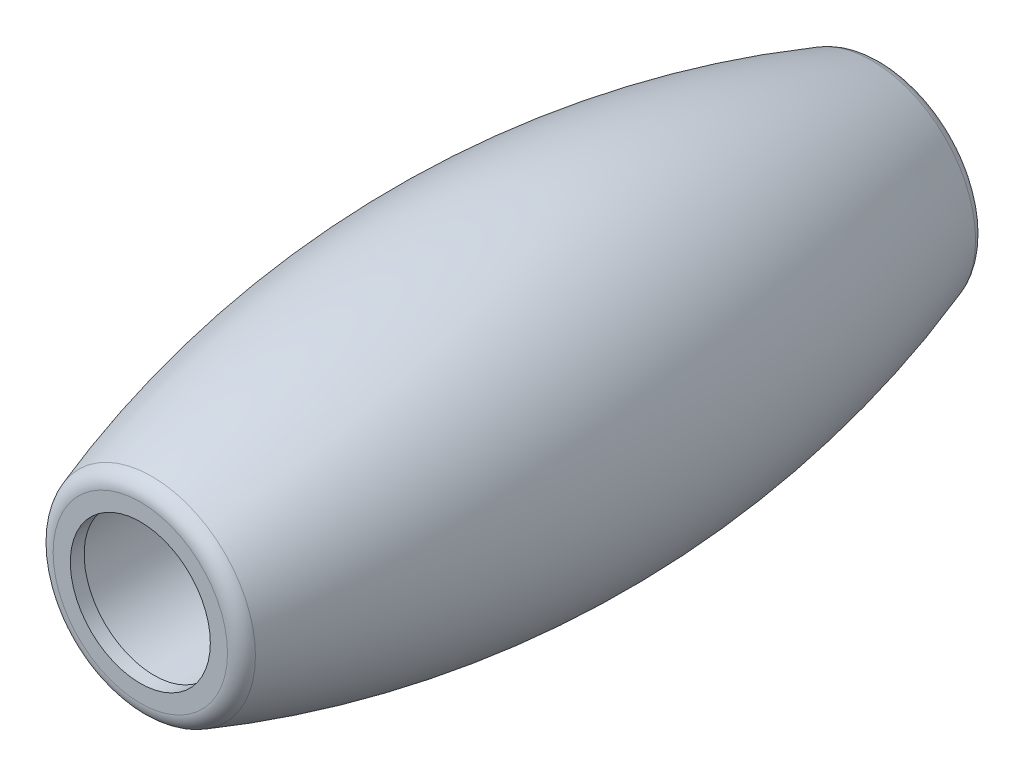
ISO-10303-21;
HEADER;
FILE_DESCRIPTION(('STEP AP214'),'2;1');
FILE_NAME('part.step','',(''),(''),'','','');
FILE_SCHEMA(('AUTOMOTIVE_DESIGN { 1 0 10303 214 1 1 1 1 }'));
ENDSEC;
DATA;
#1=APPLICATION_CONTEXT('core data for automotive mechanical design processes');
#2=APPLICATION_PROTOCOL_DEFINITION('international standard','automotive_design',2000,#1);
#3=PRODUCT_CONTEXT('',#1,'mechanical');
#4=PRODUCT('Part','Part','',(#3));
#5=PRODUCT_RELATED_PRODUCT_CATEGORY('part','',(#4));
#6=PRODUCT_DEFINITION_FORMATION('','',#4);
#7=PRODUCT_DEFINITION_CONTEXT('part definition',#1,'design');
#8=PRODUCT_DEFINITION('design','',#6,#7);
#9=PRODUCT_DEFINITION_SHAPE('','',#8);
#10=(LENGTH_UNIT() NAMED_UNIT(*) SI_UNIT(.MILLI.,.METRE.));
#11=(NAMED_UNIT(*) PLANE_ANGLE_UNIT() SI_UNIT($,.RADIAN.));
#12=(NAMED_UNIT(*) SI_UNIT($,.STERADIAN.) SOLID_ANGLE_UNIT());
#13=UNCERTAINTY_MEASURE_WITH_UNIT(LENGTH_MEASURE(1.E-05),#10,'distance_accuracy_value','');
#14=(GEOMETRIC_REPRESENTATION_CONTEXT(3) GLOBAL_UNCERTAINTY_ASSIGNED_CONTEXT((#13)) GLOBAL_UNIT_ASSIGNED_CONTEXT((#10,
#11,#12)) REPRESENTATION_CONTEXT('',''));
#15=CARTESIAN_POINT('',(0.,0.,0.));
#16=DIRECTION('',(0.,0.,1.));
#17=DIRECTION('',(1.,0.,0.));
#18=AXIS2_PLACEMENT_3D('',#15,#16,#17);
#19=CARTESIAN_POINT('',(0.,0.,0.));
#20=DIRECTION('',(0.,0.,1.));
#21=DIRECTION('',(1.,0.,0.));
#22=AXIS2_PLACEMENT_3D('',#19,#20,#21);
#23=DEGENERATE_TOROIDAL_SURFACE('',#22,32.405,38.105,.F.);
#24=CARTESIAN_POINT('',(0.,0.,-12.4967737634982));
#25=DIRECTION('',(0.,0.,1.));
#26=DIRECTION('',(1.,0.,0.));
#27=AXIS2_PLACEMENT_3D('',#24,#25,#26);
#28=CIRCLE('',#27,3.59252311623597);
#29=CARTESIAN_POINT('',(3.59252311623597,0.,-12.4967737634982));
#30=VERTEX_POINT('',#29);
#31=EDGE_CURVE('E43',#30,#30,#28,.T.);
#32=ORIENTED_EDGE('',*,*,#31,.T.);
#33=EDGE_LOOP('',(#32));
#34=FACE_BOUND('',#33,.T.);
#35=CARTESIAN_POINT('',(0.,0.,12.4967737634982));
#36=DIRECTION('',(0.,0.,-1.));
#37=DIRECTION('',(-1.,0.,0.));
#38=AXIS2_PLACEMENT_3D('',#35,#36,#37);
#39=CIRCLE('',#38,3.59252311623597);
#40=CARTESIAN_POINT('',(-3.59252311623597,0.,12.4967737634982));
#41=VERTEX_POINT('',#40);
#42=EDGE_CURVE('E47',#41,#41,#39,.T.);
#43=ORIENTED_EDGE('',*,*,#42,.T.);
#44=EDGE_LOOP('',(#43));
#45=FACE_BOUND('',#44,.T.);
#46=ADVANCED_FACE('F32',(#34,#45),#23,.F.);
#47=CARTESIAN_POINT('',(0.,2.43,12.9));
#48=DIRECTION('',(0.,0.,-1.));
#49=DIRECTION('',(-1.,0.,0.));
#50=AXIS2_PLACEMENT_3D('',#47,#48,#49);
#51=PLANE('',#50);
#52=CARTESIAN_POINT('',(0.,0.,12.9));
#53=DIRECTION('',(0.,0.,-1.));
#54=DIRECTION('',(-1.,0.,0.));
#55=AXIS2_PLACEMENT_3D('',#52,#53,#54);
#56=CIRCLE('',#55,3.02570737368928);
#57=CARTESIAN_POINT('',(-3.02570737368928,0.,12.9));
#58=VERTEX_POINT('',#57);
#59=EDGE_CURVE('E10',#58,#58,#56,.F.);
#60=ORIENTED_EDGE('',*,*,#59,.T.);
#61=EDGE_LOOP('',(#60));
#62=FACE_BOUND('',#61,.T.);
#63=CARTESIAN_POINT('',(0.,0.,12.9));
#64=DIRECTION('',(0.,0.,1.));
#65=DIRECTION('',(1.,0.,0.));
#66=AXIS2_PLACEMENT_3D('',#63,#64,#65);
#67=CIRCLE('',#66,2.43);
#68=CARTESIAN_POINT('',(2.43,0.,12.9));
#69=VERTEX_POINT('',#68);
#70=EDGE_CURVE('E52',#69,#69,#67,.T.);
#71=ORIENTED_EDGE('',*,*,#70,.F.);
#72=EDGE_LOOP('',(#71));
#73=FACE_BOUND('',#72,.T.);
#74=ADVANCED_FACE('F100',(#62,#73),#51,.F.);
#75=CARTESIAN_POINT('',(0.,0.,12.9));
#76=DIRECTION('',(0.,0.,1.));
#77=DIRECTION('',(1.,0.,0.));
#78=AXIS2_PLACEMENT_3D('',#75,#76,#77);
#79=CYLINDRICAL_SURFACE('',#78,2.43);
#80=CARTESIAN_POINT('',(0.,0.,12.42));
#81=DIRECTION('',(0.,0.,1.));
#82=DIRECTION('',(1.,0.,0.));
#83=AXIS2_PLACEMENT_3D('',#80,#81,#82);
#84=CIRCLE('',#83,2.43);
#85=CARTESIAN_POINT('',(2.43,0.,12.42));
#86=VERTEX_POINT('',#85);
#87=EDGE_CURVE('E55',#86,#86,#84,.T.);
#88=ORIENTED_EDGE('',*,*,#87,.F.);
#89=EDGE_LOOP('',(#88));
#90=FACE_BOUND('',#89,.T.);
#91=ORIENTED_EDGE('',*,*,#70,.T.);
#92=EDGE_LOOP('',(#91));
#93=FACE_BOUND('',#92,.T.);
#94=ADVANCED_FACE('F94',(#90,#93),#79,.F.);
#95=CARTESIAN_POINT('',(0.,2.7,12.42));
#96=DIRECTION('',(0.,0.,1.));
#97=DIRECTION('',(1.,0.,0.));
#98=AXIS2_PLACEMENT_3D('',#95,#96,#97);
#99=PLANE('',#98);
#100=CARTESIAN_POINT('',(0.,0.,12.42));
#101=DIRECTION('',(0.,0.,1.));
#102=DIRECTION('',(1.,0.,0.));
#103=AXIS2_PLACEMENT_3D('',#100,#101,#102);
#104=CIRCLE('',#103,2.7);
#105=CARTESIAN_POINT('',(2.7,0.,12.42));
#106=VERTEX_POINT('',#105);
#107=EDGE_CURVE('E58',#106,#106,#104,.T.);
#108=ORIENTED_EDGE('',*,*,#107,.F.);
#109=EDGE_LOOP('',(#108));
#110=FACE_BOUND('',#109,.T.);
#111=ORIENTED_EDGE('',*,*,#87,.T.);
#112=EDGE_LOOP('',(#111));
#113=FACE_BOUND('',#112,.T.);
#114=ADVANCED_FACE('F88',(#110,#113),#99,.F.);
#115=CARTESIAN_POINT('',(0.,0.,12.9));
#116=DIRECTION('',(0.,0.,1.));
#117=DIRECTION('',(1.,0.,0.));
#118=AXIS2_PLACEMENT_3D('',#115,#116,#117);
#119=CYLINDRICAL_SURFACE('',#118,2.7);
#120=CARTESIAN_POINT('',(0.,0.,-12.42));
#121=DIRECTION('',(0.,0.,1.));
#122=DIRECTION('',(1.,0.,0.));
#123=AXIS2_PLACEMENT_3D('',#120,#121,#122);
#124=CIRCLE('',#123,2.7);
#125=CARTESIAN_POINT('',(2.7,0.,-12.42));
#126=VERTEX_POINT('',#125);
#127=EDGE_CURVE('E61',#126,#126,#124,.T.);
#128=ORIENTED_EDGE('',*,*,#127,.F.);
#129=EDGE_LOOP('',(#128));
#130=FACE_BOUND('',#129,.T.);
#131=ORIENTED_EDGE('',*,*,#107,.T.);
#132=EDGE_LOOP('',(#131));
#133=FACE_BOUND('',#132,.T.);
#134=ADVANCED_FACE('F82',(#130,#133),#119,.F.);
#135=CARTESIAN_POINT('',(0.,2.7,-12.42));
#136=DIRECTION('',(0.,0.,-1.));
#137=DIRECTION('',(-1.,0.,0.));
#138=AXIS2_PLACEMENT_3D('',#135,#136,#137);
#139=PLANE('',#138);
#140=CARTESIAN_POINT('',(0.,0.,-12.42));
#141=DIRECTION('',(0.,0.,1.));
#142=DIRECTION('',(1.,0.,0.));
#143=AXIS2_PLACEMENT_3D('',#140,#141,#142);
#144=CIRCLE('',#143,2.43);
#145=CARTESIAN_POINT('',(2.43,0.,-12.42));
#146=VERTEX_POINT('',#145);
#147=EDGE_CURVE('E64',#146,#146,#144,.T.);
#148=ORIENTED_EDGE('',*,*,#147,.F.);
#149=EDGE_LOOP('',(#148));
#150=FACE_BOUND('',#149,.T.);
#151=ORIENTED_EDGE('',*,*,#127,.T.);
#152=EDGE_LOOP('',(#151));
#153=FACE_BOUND('',#152,.T.);
#154=ADVANCED_FACE('F76',(#150,#153),#139,.F.);
#155=CARTESIAN_POINT('',(0.,0.,12.9));
#156=DIRECTION('',(0.,0.,1.));
#157=DIRECTION('',(1.,0.,0.));
#158=AXIS2_PLACEMENT_3D('',#155,#156,#157);
#159=CYLINDRICAL_SURFACE('',#158,2.43);
#160=CARTESIAN_POINT('',(0.,0.,-12.9));
#161=DIRECTION('',(0.,0.,1.));
#162=DIRECTION('',(1.,0.,0.));
#163=AXIS2_PLACEMENT_3D('',#160,#161,#162);
#164=CIRCLE('',#163,2.43);
#165=CARTESIAN_POINT('',(2.43,0.,-12.9));
#166=VERTEX_POINT('',#165);
#167=EDGE_CURVE('E67',#166,#166,#164,.T.);
#168=ORIENTED_EDGE('',*,*,#167,.F.);
#169=EDGE_LOOP('',(#168));
#170=FACE_BOUND('',#169,.T.);
#171=ORIENTED_EDGE('',*,*,#147,.T.);
#172=EDGE_LOOP('',(#171));
#173=FACE_BOUND('',#172,.T.);
#174=ADVANCED_FACE('F73',(#170,#173),#159,.F.);
#175=CARTESIAN_POINT('',(0.,3.45,-12.9));
#176=DIRECTION('',(0.,0.,1.));
#177=DIRECTION('',(1.,0.,0.));
#178=AXIS2_PLACEMENT_3D('',#175,#176,#177);
#179=PLANE('',#178);
#180=CARTESIAN_POINT('',(0.,0.,-12.9));
#181=DIRECTION('',(0.,0.,1.));
#182=DIRECTION('',(1.,0.,0.));
#183=AXIS2_PLACEMENT_3D('',#180,#181,#182);
#184=CIRCLE('',#183,3.02570737368928);
#185=CARTESIAN_POINT('',(3.02570737368928,0.,-12.9));
#186=VERTEX_POINT('',#185);
#187=EDGE_CURVE('E39',#186,#186,#184,.F.);
#188=ORIENTED_EDGE('',*,*,#187,.T.);
#189=EDGE_LOOP('',(#188));
#190=FACE_BOUND('',#189,.T.);
#191=ORIENTED_EDGE('',*,*,#167,.T.);
#192=EDGE_LOOP('',(#191));
#193=FACE_BOUND('',#192,.T.);
#194=ADVANCED_FACE('F71',(#190,#193),#179,.F.);
#195=CARTESIAN_POINT('',(0.,0.,-12.3));
#196=DIRECTION('',(0.,0.,1.));
#197=DIRECTION('',(1.,0.,0.));
#198=AXIS2_PLACEMENT_3D('',#195,#196,#197);
#199=TOROIDAL_SURFACE('',#198,3.02570737368928,0.6);
#200=ORIENTED_EDGE('',*,*,#187,.F.);
#201=EDGE_LOOP('',(#200));
#202=FACE_BOUND('',#201,.T.);
#203=ORIENTED_EDGE('',*,*,#31,.F.);
#204=EDGE_LOOP('',(#203));
#205=FACE_BOUND('',#204,.T.);
#206=ADVANCED_FACE('F111',(#202,#205),#199,.T.);
#207=CARTESIAN_POINT('',(0.,0.,12.3));
#208=DIRECTION('',(0.,0.,-1.));
#209=DIRECTION('',(-1.,0.,0.));
#210=AXIS2_PLACEMENT_3D('',#207,#208,#209);
#211=TOROIDAL_SURFACE('',#210,3.02570737368928,0.6);
#212=ORIENTED_EDGE('',*,*,#42,.F.);
#213=EDGE_LOOP('',(#212));
#214=FACE_BOUND('',#213,.T.);
#215=ORIENTED_EDGE('',*,*,#59,.F.);
#216=EDGE_LOOP('',(#215));
#217=FACE_BOUND('',#216,.T.);
#218=ADVANCED_FACE('F34',(#214,#217),#211,.T.);
#219=CLOSED_SHELL('',(#46,#74,#94,#114,#134,#154,#174,#194,#206,#218));
#220=MANIFOLD_SOLID_BREP('B2',#219);
#221=ADVANCED_BREP_SHAPE_REPRESENTATION('',(#18,#220),#14);
#222=SHAPE_DEFINITION_REPRESENTATION(#9,#221);
ENDSEC;
END-ISO-10303-21;
